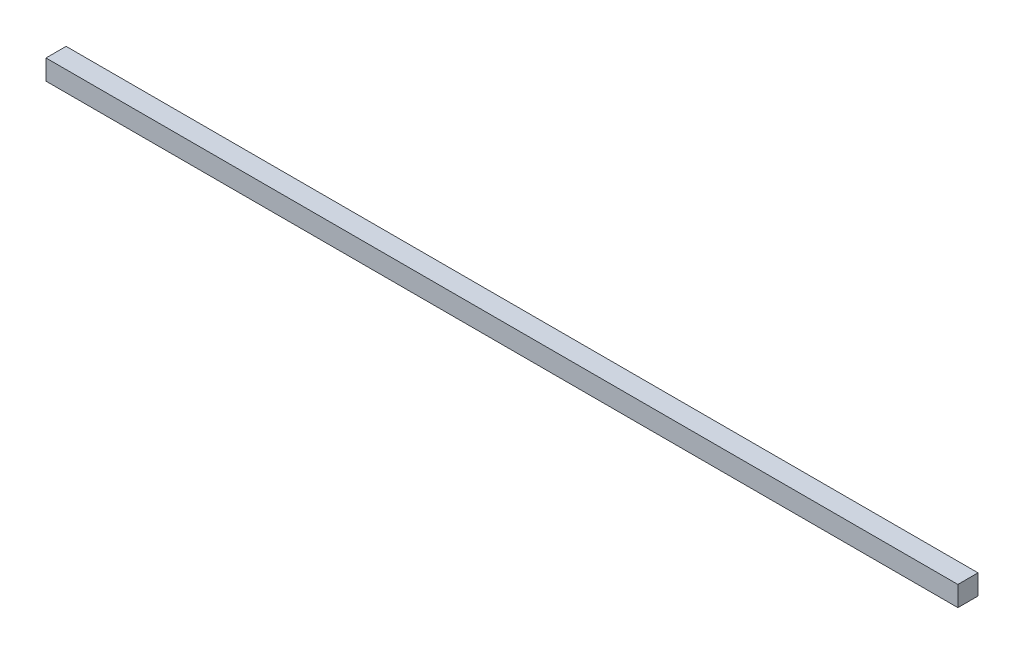
ISO-10303-21;
HEADER;
FILE_DESCRIPTION(('STEP AP214'),'2;1');
FILE_NAME('part.step','',(''),(''),'','','');
FILE_SCHEMA(('AUTOMOTIVE_DESIGN { 1 0 10303 214 1 1 1 1 }'));
ENDSEC;
DATA;
#1=APPLICATION_CONTEXT('core data for automotive mechanical design processes');
#2=APPLICATION_PROTOCOL_DEFINITION('international standard','automotive_design',2000,#1);
#3=PRODUCT_CONTEXT('',#1,'mechanical');
#4=PRODUCT('Part','Part','',(#3));
#5=PRODUCT_RELATED_PRODUCT_CATEGORY('part','',(#4));
#6=PRODUCT_DEFINITION_FORMATION('','',#4);
#7=PRODUCT_DEFINITION_CONTEXT('part definition',#1,'design');
#8=PRODUCT_DEFINITION('design','',#6,#7);
#9=PRODUCT_DEFINITION_SHAPE('','',#8);
#10=(LENGTH_UNIT() NAMED_UNIT(*) SI_UNIT(.MILLI.,.METRE.));
#11=(NAMED_UNIT(*) PLANE_ANGLE_UNIT() SI_UNIT($,.RADIAN.));
#12=(NAMED_UNIT(*) SI_UNIT($,.STERADIAN.) SOLID_ANGLE_UNIT());
#13=UNCERTAINTY_MEASURE_WITH_UNIT(LENGTH_MEASURE(1.E-05),#10,'distance_accuracy_value','');
#14=(GEOMETRIC_REPRESENTATION_CONTEXT(3) GLOBAL_UNCERTAINTY_ASSIGNED_CONTEXT((#13)) GLOBAL_UNIT_ASSIGNED_CONTEXT((#10,
#11,#12)) REPRESENTATION_CONTEXT('',''));
#15=CARTESIAN_POINT('',(0.,0.,0.));
#16=DIRECTION('',(0.,0.,1.));
#17=DIRECTION('',(1.,0.,0.));
#18=AXIS2_PLACEMENT_3D('',#15,#16,#17);
#19=CARTESIAN_POINT('',(-83.3544303797468,-0.0100000000000031,19.1518987341772));
#20=DIRECTION('',(0.,0.,-1.));
#21=DIRECTION('',(-1.,0.,0.));
#22=AXIS2_PLACEMENT_3D('',#19,#20,#21);
#23=PLANE('',#22);
#24=DIRECTION('',(0.,1.,0.));
#25=VECTOR('',#24,1.);
#26=CARTESIAN_POINT('',(52.6371308016878,-0.0100000000000031,19.1518987341772));
#27=LINE('',#26,#25);
#28=CARTESIAN_POINT('',(52.6371308016878,0.,19.1518987341772));
#29=VERTEX_POINT('',#28);
#30=CARTESIAN_POINT('',(52.6371308016878,3.,19.1518987341772));
#31=VERTEX_POINT('',#30);
#32=EDGE_CURVE('E11',#29,#31,#27,.T.);
#33=ORIENTED_EDGE('',*,*,#32,.F.);
#34=DIRECTION('',(-1.,0.,0.));
#35=VECTOR('',#34,1.);
#36=CARTESIAN_POINT('',(0.,0.,19.1518987341772));
#37=LINE('',#36,#35);
#38=CARTESIAN_POINT('',(-83.3544303797468,0.,19.1518987341772));
#39=VERTEX_POINT('',#38);
#40=EDGE_CURVE('E91',#29,#39,#37,.T.);
#41=ORIENTED_EDGE('',*,*,#40,.T.);
#42=DIRECTION('',(0.,1.,0.));
#43=VECTOR('',#42,1.);
#44=CARTESIAN_POINT('',(-83.3544303797468,-0.0100000000000031,19.1518987341772));
#45=LINE('',#44,#43);
#46=CARTESIAN_POINT('',(-83.3544303797468,3.,19.1518987341772));
#47=VERTEX_POINT('',#46);
#48=EDGE_CURVE('E40',#39,#47,#45,.T.);
#49=ORIENTED_EDGE('',*,*,#48,.T.);
#50=DIRECTION('',(-1.,0.,0.));
#51=VECTOR('',#50,1.);
#52=CARTESIAN_POINT('',(0.,3.,19.1518987341772));
#53=LINE('',#52,#51);
#54=EDGE_CURVE('E99',#31,#47,#53,.T.);
#55=ORIENTED_EDGE('',*,*,#54,.F.);
#56=EDGE_LOOP('',(#33,#41,#49,#55));
#57=FACE_BOUND('',#56,.T.);
#58=ADVANCED_FACE('F32',(#57),#23,.T.);
#59=CARTESIAN_POINT('',(52.6371308016878,-0.0100000000000031,22.1518987341772));
#60=DIRECTION('',(1.,0.,0.));
#61=DIRECTION('',(0.,0.,-1.));
#62=AXIS2_PLACEMENT_3D('',#59,#60,#61);
#63=PLANE('',#62);
#64=DIRECTION('',(0.,-1.,0.));
#65=VECTOR('',#64,1.);
#66=CARTESIAN_POINT('',(52.6371308016877,50.,22.1518987341772));
#67=LINE('',#66,#65);
#68=CARTESIAN_POINT('',(52.6371308016877,3.,22.1518987341772));
#69=VERTEX_POINT('',#68);
#70=CARTESIAN_POINT('',(52.6371308016878,0.,22.1518987341772));
#71=VERTEX_POINT('',#70);
#72=EDGE_CURVE('E86',#69,#71,#67,.T.);
#73=ORIENTED_EDGE('',*,*,#72,.T.);
#74=DIRECTION('',(0.,0.,-1.));
#75=VECTOR('',#74,1.);
#76=CARTESIAN_POINT('',(52.6371308016879,0.,2.43495644026E-13));
#77=LINE('',#76,#75);
#78=EDGE_CURVE('E75',#71,#29,#77,.T.);
#79=ORIENTED_EDGE('',*,*,#78,.T.);
#80=ORIENTED_EDGE('',*,*,#32,.T.);
#81=DIRECTION('',(0.,0.,-1.));
#82=VECTOR('',#81,1.);
#83=CARTESIAN_POINT('',(52.6371308016879,3.,2.43495644026E-13));
#84=LINE('',#83,#82);
#85=EDGE_CURVE('E96',#69,#31,#84,.T.);
#86=ORIENTED_EDGE('',*,*,#85,.F.);
#87=EDGE_LOOP('',(#73,#79,#80,#86));
#88=FACE_BOUND('',#87,.T.);
#89=ADVANCED_FACE('F105',(#88),#63,.T.);
#90=CARTESIAN_POINT('',(-83.3544303797468,-0.0100000000000031,22.1518987341772));
#91=DIRECTION('',(-1.,0.,0.));
#92=DIRECTION('',(0.,0.,1.));
#93=AXIS2_PLACEMENT_3D('',#90,#91,#92);
#94=PLANE('',#93);
#95=ORIENTED_EDGE('',*,*,#48,.F.);
#96=DIRECTION('',(0.,0.,1.));
#97=VECTOR('',#96,1.);
#98=CARTESIAN_POINT('',(-83.3544303797468,0.,0.));
#99=LINE('',#98,#97);
#100=CARTESIAN_POINT('',(-83.3544303797468,0.,22.1518987341772));
#101=VERTEX_POINT('',#100);
#102=EDGE_CURVE('E73',#39,#101,#99,.T.);
#103=ORIENTED_EDGE('',*,*,#102,.T.);
#104=DIRECTION('',(0.,1.,0.));
#105=VECTOR('',#104,1.);
#106=CARTESIAN_POINT('',(-83.3544303797468,-0.0100000000000031,22.1518987341772));
#107=LINE('',#106,#105);
#108=CARTESIAN_POINT('',(-83.3544303797468,3.,22.1518987341772));
#109=VERTEX_POINT('',#108);
#110=EDGE_CURVE('E82',#101,#109,#107,.T.);
#111=ORIENTED_EDGE('',*,*,#110,.T.);
#112=DIRECTION('',(0.,0.,1.));
#113=VECTOR('',#112,1.);
#114=CARTESIAN_POINT('',(-83.3544303797468,3.,0.));
#115=LINE('',#114,#113);
#116=EDGE_CURVE('E85',#47,#109,#115,.T.);
#117=ORIENTED_EDGE('',*,*,#116,.F.);
#118=EDGE_LOOP('',(#95,#103,#111,#117));
#119=FACE_BOUND('',#118,.T.);
#120=ADVANCED_FACE('F88',(#119),#94,.T.);
#121=CARTESIAN_POINT('',(0.,0.,0.));
#122=DIRECTION('',(0.,1.,0.));
#123=DIRECTION('',(0.,0.,1.));
#124=AXIS2_PLACEMENT_3D('',#121,#122,#123);
#125=PLANE('',#124);
#126=ORIENTED_EDGE('',*,*,#102,.F.);
#127=ORIENTED_EDGE('',*,*,#40,.F.);
#128=ORIENTED_EDGE('',*,*,#78,.F.);
#129=DIRECTION('',(1.,0.,0.));
#130=VECTOR('',#129,1.);
#131=CARTESIAN_POINT('',(-98.3544303797468,0.,22.1518987341772));
#132=LINE('',#131,#130);
#133=EDGE_CURVE('E71',#101,#71,#132,.T.);
#134=ORIENTED_EDGE('',*,*,#133,.F.);
#135=EDGE_LOOP('',(#126,#127,#128,#134));
#136=FACE_BOUND('',#135,.T.);
#137=ADVANCED_FACE('F34',(#136),#125,.F.);
#138=CARTESIAN_POINT('',(-98.3544303797468,50.,22.1518987341772));
#139=DIRECTION('',(0.,0.,-1.));
#140=DIRECTION('',(-1.,0.,0.));
#141=AXIS2_PLACEMENT_3D('',#138,#139,#140);
#142=PLANE('',#141);
#143=ORIENTED_EDGE('',*,*,#110,.F.);
#144=ORIENTED_EDGE('',*,*,#133,.T.);
#145=ORIENTED_EDGE('',*,*,#72,.F.);
#146=DIRECTION('',(-1.,0.,0.));
#147=VECTOR('',#146,1.);
#148=CARTESIAN_POINT('',(-98.3544303797468,3.,22.1518987341772));
#149=LINE('',#148,#147);
#150=EDGE_CURVE('E79',#69,#109,#149,.T.);
#151=ORIENTED_EDGE('',*,*,#150,.T.);
#152=EDGE_LOOP('',(#143,#144,#145,#151));
#153=FACE_BOUND('',#152,.T.);
#154=ADVANCED_FACE('F83',(#153),#142,.F.);
#155=CARTESIAN_POINT('',(0.,3.,0.));
#156=DIRECTION('',(0.,1.,0.));
#157=DIRECTION('',(0.,0.,1.));
#158=AXIS2_PLACEMENT_3D('',#155,#156,#157);
#159=PLANE('',#158);
#160=ORIENTED_EDGE('',*,*,#54,.T.);
#161=ORIENTED_EDGE('',*,*,#116,.T.);
#162=ORIENTED_EDGE('',*,*,#150,.F.);
#163=ORIENTED_EDGE('',*,*,#85,.T.);
#164=EDGE_LOOP('',(#160,#161,#162,#163));
#165=FACE_BOUND('',#164,.T.);
#166=ADVANCED_FACE('F102',(#165),#159,.T.);
#167=CLOSED_SHELL('',(#58,#89,#120,#137,#154,#166));
#168=MANIFOLD_SOLID_BREP('B2',#167);
#169=ADVANCED_BREP_SHAPE_REPRESENTATION('',(#18,#168),#14);
#170=SHAPE_DEFINITION_REPRESENTATION(#9,#169);
ENDSEC;
END-ISO-10303-21;
